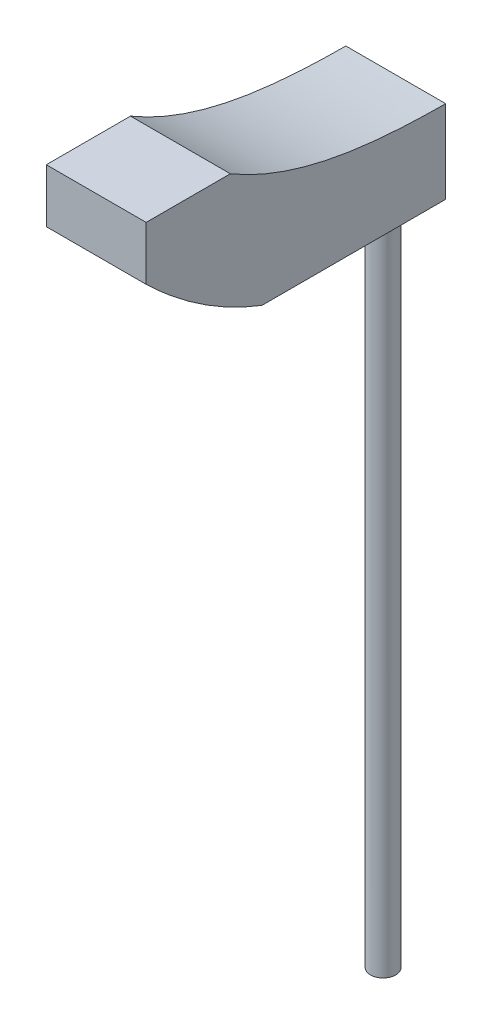
ISO-10303-21;
HEADER;
FILE_DESCRIPTION(('STEP AP214'),'2;1');
FILE_NAME('part.step','',(''),(''),'','','');
FILE_SCHEMA(('AUTOMOTIVE_DESIGN { 1 0 10303 214 1 1 1 1 }'));
ENDSEC;
DATA;
#1=APPLICATION_CONTEXT('core data for automotive mechanical design processes');
#2=APPLICATION_PROTOCOL_DEFINITION('international standard','automotive_design',2000,#1);
#3=PRODUCT_CONTEXT('',#1,'mechanical');
#4=PRODUCT('Part','Part','',(#3));
#5=PRODUCT_RELATED_PRODUCT_CATEGORY('part','',(#4));
#6=PRODUCT_DEFINITION_FORMATION('','',#4);
#7=PRODUCT_DEFINITION_CONTEXT('part definition',#1,'design');
#8=PRODUCT_DEFINITION('design','',#6,#7);
#9=PRODUCT_DEFINITION_SHAPE('','',#8);
#10=(LENGTH_UNIT() NAMED_UNIT(*) SI_UNIT(.MILLI.,.METRE.));
#11=(NAMED_UNIT(*) PLANE_ANGLE_UNIT() SI_UNIT($,.RADIAN.));
#12=(NAMED_UNIT(*) SI_UNIT($,.STERADIAN.) SOLID_ANGLE_UNIT());
#13=UNCERTAINTY_MEASURE_WITH_UNIT(LENGTH_MEASURE(1.E-05),#10,'distance_accuracy_value','');
#14=(GEOMETRIC_REPRESENTATION_CONTEXT(3) GLOBAL_UNCERTAINTY_ASSIGNED_CONTEXT((#13)) GLOBAL_UNIT_ASSIGNED_CONTEXT((#10,
#11,#12)) REPRESENTATION_CONTEXT('',''));
#15=CARTESIAN_POINT('',(0.,0.,0.));
#16=DIRECTION('',(0.,0.,1.));
#17=DIRECTION('',(1.,0.,0.));
#18=AXIS2_PLACEMENT_3D('',#15,#16,#17);
#19=CARTESIAN_POINT('',(0.,815.,0.));
#20=DIRECTION('',(0.,-1.,0.));
#21=DIRECTION('',(0.,0.,-1.));
#22=AXIS2_PLACEMENT_3D('',#19,#20,#21);
#23=CYLINDRICAL_SURFACE('',#22,12.7);
#24=CARTESIAN_POINT('',(0.,0.,0.));
#25=DIRECTION('',(0.,1.,0.));
#26=DIRECTION('',(0.,0.,1.));
#27=AXIS2_PLACEMENT_3D('',#24,#25,#26);
#28=CIRCLE('',#27,12.7);
#29=CARTESIAN_POINT('',(0.,0.,12.7));
#30=VERTEX_POINT('',#29);
#31=EDGE_CURVE('E132',#30,#30,#28,.T.);
#32=ORIENTED_EDGE('',*,*,#31,.T.);
#33=EDGE_LOOP('',(#32));
#34=FACE_BOUND('',#33,.T.);
#35=CARTESIAN_POINT('',(0.,685.,0.));
#36=DIRECTION('',(0.,1.,0.));
#37=DIRECTION('',(0.,0.,1.));
#38=AXIS2_PLACEMENT_3D('',#35,#36,#37);
#39=CIRCLE('',#38,12.7);
#40=CARTESIAN_POINT('',(0.,685.,-12.7));
#41=VERTEX_POINT('',#40);
#42=EDGE_CURVE('E41',#41,#41,#39,.T.);
#43=ORIENTED_EDGE('',*,*,#42,.F.);
#44=EDGE_LOOP('',(#43));
#45=FACE_BOUND('',#44,.T.);
#46=ADVANCED_FACE('F32',(#34,#45),#23,.T.);
#47=CARTESIAN_POINT('',(0.,0.,0.));
#48=DIRECTION('',(0.,1.,0.));
#49=DIRECTION('',(0.,0.,1.));
#50=AXIS2_PLACEMENT_3D('',#47,#48,#49);
#51=PLANE('',#50);
#52=ORIENTED_EDGE('',*,*,#31,.F.);
#53=EDGE_LOOP('',(#52));
#54=FACE_BOUND('',#53,.T.);
#55=ADVANCED_FACE('F139',(#54),#51,.F.);
#56=CARTESIAN_POINT('',(0.,685.,0.));
#57=DIRECTION('',(0.,1.,0.));
#58=DIRECTION('',(0.,0.,1.));
#59=AXIS2_PLACEMENT_3D('',#56,#57,#58);
#60=PLANE('',#59);
#61=DIRECTION('',(0.,0.,-1.));
#62=VECTOR('',#61,1.);
#63=CARTESIAN_POINT('',(50.,685.,287.3));
#64=LINE('',#63,#62);
#65=CARTESIAN_POINT('',(50.,684.999999999959,171.328267122483));
#66=VERTEX_POINT('',#65);
#67=CARTESIAN_POINT('',(50.,685.,-12.7));
#68=VERTEX_POINT('',#67);
#69=EDGE_CURVE('E100',#66,#68,#64,.T.);
#70=ORIENTED_EDGE('',*,*,#69,.F.);
#71=DIRECTION('',(1.,0.,0.));
#72=VECTOR('',#71,1.);
#73=CARTESIAN_POINT('',(-50.,685.,171.32826712259));
#74=LINE('',#73,#72);
#75=CARTESIAN_POINT('',(-50.,684.999999999959,171.328267122483));
#76=VERTEX_POINT('',#75);
#77=EDGE_CURVE('E86',#66,#76,#74,.F.);
#78=ORIENTED_EDGE('',*,*,#77,.T.);
#79=DIRECTION('',(0.,0.,1.));
#80=VECTOR('',#79,1.);
#81=CARTESIAN_POINT('',(-50.,685.,-12.7));
#82=LINE('',#81,#80);
#83=CARTESIAN_POINT('',(-50.,685.,-12.7));
#84=VERTEX_POINT('',#83);
#85=EDGE_CURVE('E111',#84,#76,#82,.T.);
#86=ORIENTED_EDGE('',*,*,#85,.F.);
#87=DIRECTION('',(-1.,0.,0.));
#88=VECTOR('',#87,1.);
#89=CARTESIAN_POINT('',(50.,685.,-12.7));
#90=LINE('',#89,#88);
#91=EDGE_CURVE('E129',#41,#84,#90,.T.);
#92=ORIENTED_EDGE('',*,*,#91,.F.);
#93=ORIENTED_EDGE('',*,*,#42,.T.);
#94=EDGE_CURVE('E109',#68,#41,#90,.T.);
#95=ORIENTED_EDGE('',*,*,#94,.F.);
#96=EDGE_LOOP('',(#70,#78,#86,#92,#93,#95));
#97=FACE_BOUND('',#96,.T.);
#98=ADVANCED_FACE('F106',(#97),#60,.F.);
#99=CARTESIAN_POINT('',(0.,685.,-12.7));
#100=DIRECTION('',(0.,0.,-1.));
#101=DIRECTION('',(-1.,0.,0.));
#102=AXIS2_PLACEMENT_3D('',#99,#100,#101);
#103=PLANE('',#102);
#104=DIRECTION('',(1.,0.,0.));
#105=VECTOR('',#104,1.);
#106=CARTESIAN_POINT('',(-50.,767.965857972163,-12.7));
#107=LINE('',#106,#105);
#108=CARTESIAN_POINT('',(50.,767.965857972163,-12.6999999999988));
#109=VERTEX_POINT('',#108);
#110=CARTESIAN_POINT('',(-50.,767.965857972163,-12.6999999999988));
#111=VERTEX_POINT('',#110);
#112=EDGE_CURVE('E123',#109,#111,#107,.F.);
#113=ORIENTED_EDGE('',*,*,#112,.F.);
#114=DIRECTION('',(0.,1.,0.));
#115=VECTOR('',#114,1.);
#116=CARTESIAN_POINT('',(50.,685.,-12.7));
#117=LINE('',#116,#115);
#118=EDGE_CURVE('E130',#68,#109,#117,.T.);
#119=ORIENTED_EDGE('',*,*,#118,.F.);
#120=ORIENTED_EDGE('',*,*,#94,.T.);
#121=ORIENTED_EDGE('',*,*,#91,.T.);
#122=DIRECTION('',(0.,1.,0.));
#123=VECTOR('',#122,1.);
#124=CARTESIAN_POINT('',(-50.,685.,-12.7));
#125=LINE('',#124,#123);
#126=EDGE_CURVE('E110',#84,#111,#125,.T.);
#127=ORIENTED_EDGE('',*,*,#126,.T.);
#128=EDGE_LOOP('',(#113,#119,#120,#121,#127));
#129=FACE_BOUND('',#128,.T.);
#130=ADVANCED_FACE('F151',(#129),#103,.T.);
#131=CARTESIAN_POINT('',(50.,685.,287.3));
#132=DIRECTION('',(1.,0.,0.));
#133=DIRECTION('',(0.,0.,-1.));
#134=AXIS2_PLACEMENT_3D('',#131,#132,#133);
#135=PLANE('',#134);
#136=CARTESIAN_POINT('',(50.,665.742090058925,63.7926642771185));
#137=CARTESIAN_POINT('',(50.,664.797399326405,196.773017202223));
#138=CARTESIAN_POINT('',(50.,775.832281678043,301.698496964454));
#139=B_SPLINE_CURVE_WITH_KNOTS('',2,(#136,#137,#138),.UNSPECIFIED.,.F.,.F.,(3,3),(0.,1.),.UNSPECIFIED.);
#140=CARTESIAN_POINT('',(50.,761.250390294595,287.300000000001));
#141=VERTEX_POINT('',#140);
#142=EDGE_CURVE('E89',#66,#141,#139,.T.);
#143=ORIENTED_EDGE('',*,*,#142,.F.);
#144=ORIENTED_EDGE('',*,*,#69,.T.);
#145=ORIENTED_EDGE('',*,*,#118,.T.);
#146=CARTESIAN_POINT('',(50.,815.,202.978744698331));
#147=CARTESIAN_POINT('',(50.,766.120158396165,120.41306890551));
#148=CARTESIAN_POINT('',(50.,766.761518937479,24.4847807868558));
#149=CARTESIAN_POINT('',(50.,768.490286219222,-67.4028631972174));
#150=B_SPLINE_CURVE_WITH_KNOTS('',3,(#146,#147,#148,#149),.UNSPECIFIED.,.F.,.F.,(4,4),(0.,1.),.UNSPECIFIED.);
#151=CARTESIAN_POINT('',(50.,815.,202.978744698331));
#152=VERTEX_POINT('',#151);
#153=EDGE_CURVE('E94',#152,#109,#150,.T.);
#154=ORIENTED_EDGE('',*,*,#153,.F.);
#155=DIRECTION('',(0.,0.,-1.));
#156=VECTOR('',#155,1.);
#157=CARTESIAN_POINT('',(50.,815.,287.3));
#158=LINE('',#157,#156);
#159=CARTESIAN_POINT('',(50.,815.,287.3));
#160=VERTEX_POINT('',#159);
#161=EDGE_CURVE('E126',#160,#152,#158,.T.);
#162=ORIENTED_EDGE('',*,*,#161,.F.);
#163=DIRECTION('',(0.,1.,0.));
#164=VECTOR('',#163,1.);
#165=CARTESIAN_POINT('',(50.,685.,287.3));
#166=LINE('',#165,#164);
#167=EDGE_CURVE('E103',#141,#160,#166,.T.);
#168=ORIENTED_EDGE('',*,*,#167,.F.);
#169=EDGE_LOOP('',(#143,#144,#145,#154,#162,#168));
#170=FACE_BOUND('',#169,.T.);
#171=ADVANCED_FACE('F98',(#170),#135,.T.);
#172=CARTESIAN_POINT('',(-50.,685.,287.3));
#173=DIRECTION('',(0.,0.,1.));
#174=DIRECTION('',(1.,0.,0.));
#175=AXIS2_PLACEMENT_3D('',#172,#173,#174);
#176=PLANE('',#175);
#177=DIRECTION('',(1.,0.,0.));
#178=VECTOR('',#177,1.);
#179=CARTESIAN_POINT('',(-50.,761.250390294594,287.3));
#180=LINE('',#179,#178);
#181=CARTESIAN_POINT('',(-50.,761.250390294595,287.3));
#182=VERTEX_POINT('',#181);
#183=EDGE_CURVE('E47',#141,#182,#180,.F.);
#184=ORIENTED_EDGE('',*,*,#183,.F.);
#185=ORIENTED_EDGE('',*,*,#167,.T.);
#186=DIRECTION('',(1.,0.,0.));
#187=VECTOR('',#186,1.);
#188=CARTESIAN_POINT('',(-50.,815.,287.3));
#189=LINE('',#188,#187);
#190=CARTESIAN_POINT('',(-50.,815.,287.3));
#191=VERTEX_POINT('',#190);
#192=EDGE_CURVE('E122',#191,#160,#189,.T.);
#193=ORIENTED_EDGE('',*,*,#192,.F.);
#194=DIRECTION('',(0.,1.,0.));
#195=VECTOR('',#194,1.);
#196=CARTESIAN_POINT('',(-50.,685.,287.3));
#197=LINE('',#196,#195);
#198=EDGE_CURVE('E114',#182,#191,#197,.T.);
#199=ORIENTED_EDGE('',*,*,#198,.F.);
#200=EDGE_LOOP('',(#184,#185,#193,#199));
#201=FACE_BOUND('',#200,.T.);
#202=ADVANCED_FACE('F165',(#201),#176,.T.);
#203=CARTESIAN_POINT('',(-50.,685.,-12.7));
#204=DIRECTION('',(-1.,0.,0.));
#205=DIRECTION('',(0.,0.,1.));
#206=AXIS2_PLACEMENT_3D('',#203,#204,#205);
#207=PLANE('',#206);
#208=CARTESIAN_POINT('',(-50.,665.742090058925,63.7926642771185));
#209=CARTESIAN_POINT('',(-50.,664.797399326405,196.773017202223));
#210=CARTESIAN_POINT('',(-50.,775.832281678043,301.698496964454));
#211=B_SPLINE_CURVE_WITH_KNOTS('',2,(#208,#209,#210),.UNSPECIFIED.,.F.,.F.,(3,3),(0.,1.),.UNSPECIFIED.);
#212=EDGE_CURVE('E11',#182,#76,#211,.F.);
#213=ORIENTED_EDGE('',*,*,#212,.F.);
#214=ORIENTED_EDGE('',*,*,#198,.T.);
#215=DIRECTION('',(0.,0.,1.));
#216=VECTOR('',#215,1.);
#217=CARTESIAN_POINT('',(-50.,815.,-12.7));
#218=LINE('',#217,#216);
#219=CARTESIAN_POINT('',(-50.,815.,202.978744698331));
#220=VERTEX_POINT('',#219);
#221=EDGE_CURVE('E119',#220,#191,#218,.T.);
#222=ORIENTED_EDGE('',*,*,#221,.F.);
#223=CARTESIAN_POINT('',(-50.,815.,202.978744698331));
#224=CARTESIAN_POINT('',(-50.,766.120158396165,120.41306890551));
#225=CARTESIAN_POINT('',(-50.,766.761518937479,24.4847807868558));
#226=CARTESIAN_POINT('',(-50.,768.490286219222,-67.4028631972174));
#227=B_SPLINE_CURVE_WITH_KNOTS('',3,(#223,#224,#225,#226),.UNSPECIFIED.,.F.,.F.,(4,4),(0.,1.),.UNSPECIFIED.);
#228=EDGE_CURVE('E55',#220,#111,#227,.T.);
#229=ORIENTED_EDGE('',*,*,#228,.T.);
#230=ORIENTED_EDGE('',*,*,#126,.F.);
#231=ORIENTED_EDGE('',*,*,#85,.T.);
#232=EDGE_LOOP('',(#213,#214,#222,#229,#230,#231));
#233=FACE_BOUND('',#232,.T.);
#234=ADVANCED_FACE('F158',(#233),#207,.T.);
#235=CARTESIAN_POINT('',(0.,815.,0.));
#236=DIRECTION('',(0.,1.,0.));
#237=DIRECTION('',(0.,0.,1.));
#238=AXIS2_PLACEMENT_3D('',#235,#236,#237);
#239=PLANE('',#238);
#240=DIRECTION('',(1.,0.,0.));
#241=VECTOR('',#240,1.);
#242=CARTESIAN_POINT('',(-50.,815.,202.978744698331));
#243=LINE('',#242,#241);
#244=EDGE_CURVE('E180',#220,#152,#243,.T.);
#245=ORIENTED_EDGE('',*,*,#244,.F.);
#246=ORIENTED_EDGE('',*,*,#221,.T.);
#247=ORIENTED_EDGE('',*,*,#192,.T.);
#248=ORIENTED_EDGE('',*,*,#161,.T.);
#249=EDGE_LOOP('',(#245,#246,#247,#248));
#250=FACE_BOUND('',#249,.T.);
#251=ADVANCED_FACE('F154',(#250),#239,.T.);
#252=DIRECTION('',(1.,0.,0.));
#253=VECTOR('',#252,1.);
#254=SURFACE_OF_LINEAR_EXTRUSION('',#227,#253);
#255=ORIENTED_EDGE('',*,*,#112,.T.);
#256=ORIENTED_EDGE('',*,*,#228,.F.);
#257=ORIENTED_EDGE('',*,*,#244,.T.);
#258=ORIENTED_EDGE('',*,*,#153,.T.);
#259=EDGE_LOOP('',(#255,#256,#257,#258));
#260=FACE_BOUND('',#259,.T.);
#261=ADVANCED_FACE('F157',(#260),#254,.F.);
#262=CARTESIAN_POINT('',(-50.,665.742090058925,63.7926642771185));
#263=CARTESIAN_POINT('',(-50.,664.797399326405,196.773017202223));
#264=CARTESIAN_POINT('',(-50.,775.832281678043,301.698496964454));
#265=B_SPLINE_CURVE_WITH_KNOTS('',2,(#262,#263,#264),.UNSPECIFIED.,.F.,.F.,(3,3),(0.,1.),.UNSPECIFIED.);
#266=DIRECTION('',(1.,0.,0.));
#267=VECTOR('',#266,1.);
#268=SURFACE_OF_LINEAR_EXTRUSION('',#265,#267);
#269=ORIENTED_EDGE('',*,*,#142,.T.);
#270=ORIENTED_EDGE('',*,*,#183,.T.);
#271=ORIENTED_EDGE('',*,*,#212,.T.);
#272=ORIENTED_EDGE('',*,*,#77,.F.);
#273=EDGE_LOOP('',(#269,#270,#271,#272));
#274=FACE_BOUND('',#273,.T.);
#275=ADVANCED_FACE('F88',(#274),#268,.F.);
#276=CLOSED_SHELL('',(#46,#55,#98,#130,#171,#202,#234,#251,#261,#275));
#277=MANIFOLD_SOLID_BREP('B2',#276);
#278=ADVANCED_BREP_SHAPE_REPRESENTATION('',(#18,#277),#14);
#279=SHAPE_DEFINITION_REPRESENTATION(#9,#278);
ENDSEC;
END-ISO-10303-21;
